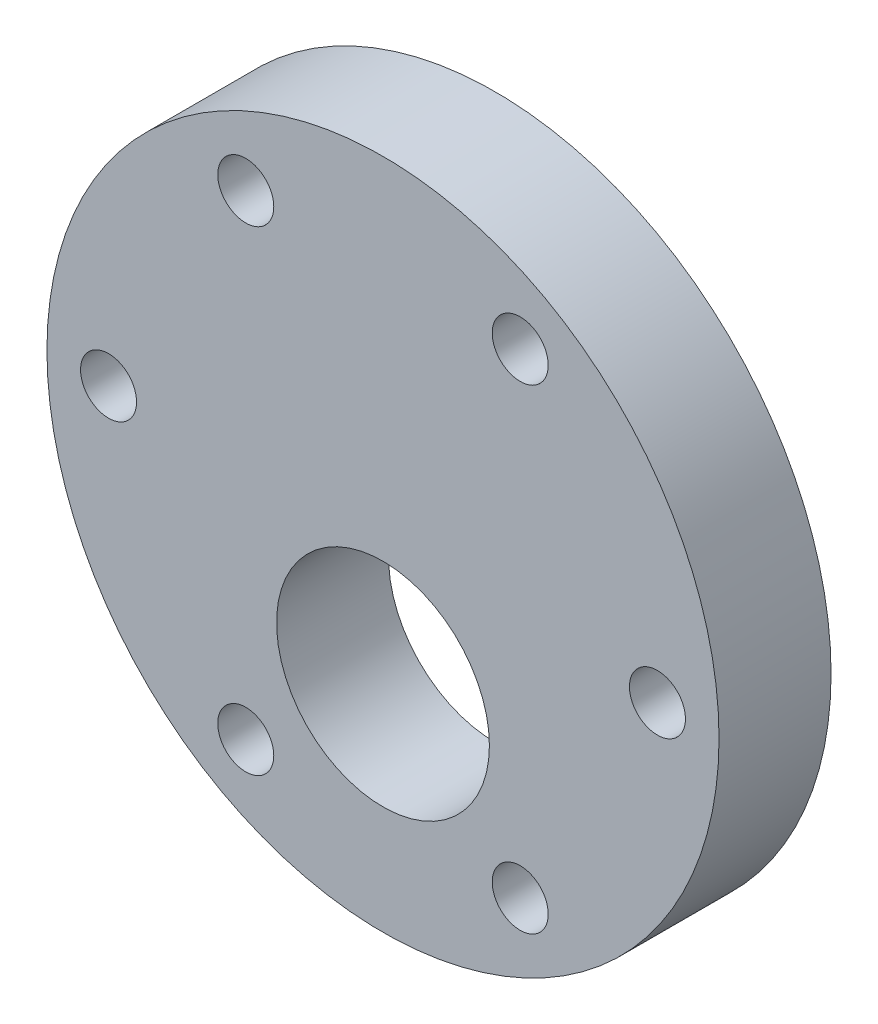
ISO-10303-21;
HEADER;
FILE_DESCRIPTION(('STEP AP214'),'2;1');
FILE_NAME('part.step','',(''),(''),'','','');
FILE_SCHEMA(('AUTOMOTIVE_DESIGN { 1 0 10303 214 1 1 1 1 }'));
ENDSEC;
DATA;
#1=APPLICATION_CONTEXT('core data for automotive mechanical design processes');
#2=APPLICATION_PROTOCOL_DEFINITION('international standard','automotive_design',2000,#1);
#3=PRODUCT_CONTEXT('',#1,'mechanical');
#4=PRODUCT('Part','Part','',(#3));
#5=PRODUCT_RELATED_PRODUCT_CATEGORY('part','',(#4));
#6=PRODUCT_DEFINITION_FORMATION('','',#4);
#7=PRODUCT_DEFINITION_CONTEXT('part definition',#1,'design');
#8=PRODUCT_DEFINITION('design','',#6,#7);
#9=PRODUCT_DEFINITION_SHAPE('','',#8);
#10=(LENGTH_UNIT() NAMED_UNIT(*) SI_UNIT(.MILLI.,.METRE.));
#11=(NAMED_UNIT(*) PLANE_ANGLE_UNIT() SI_UNIT($,.RADIAN.));
#12=(NAMED_UNIT(*) SI_UNIT($,.STERADIAN.) SOLID_ANGLE_UNIT());
#13=UNCERTAINTY_MEASURE_WITH_UNIT(LENGTH_MEASURE(1.E-05),#10,'distance_accuracy_value','');
#14=(GEOMETRIC_REPRESENTATION_CONTEXT(3) GLOBAL_UNCERTAINTY_ASSIGNED_CONTEXT((#13)) GLOBAL_UNIT_ASSIGNED_CONTEXT((#10,
#11,#12)) REPRESENTATION_CONTEXT('',''));
#15=CARTESIAN_POINT('',(0.,0.,0.));
#16=DIRECTION('',(0.,0.,1.));
#17=DIRECTION('',(1.,0.,0.));
#18=AXIS2_PLACEMENT_3D('',#15,#16,#17);
#19=CARTESIAN_POINT('',(0.,0.,6.35));
#20=DIRECTION('',(0.,0.,1.));
#21=DIRECTION('',(1.,0.,0.));
#22=AXIS2_PLACEMENT_3D('',#19,#20,#21);
#23=PLANE('',#22);
#24=CARTESIAN_POINT('',(-7.77874999999988,-13.473190219376,6.35));
#25=DIRECTION('',(0.,0.,1.));
#26=DIRECTION('',(1.,0.,0.));
#27=AXIS2_PLACEMENT_3D('',#24,#25,#26);
#28=CIRCLE('',#27,1.5875);
#29=CARTESIAN_POINT('',(-6.19124999999988,-13.473190219376,6.35));
#30=VERTEX_POINT('',#29);
#31=EDGE_CURVE('E94',#30,#30,#28,.T.);
#32=ORIENTED_EDGE('',*,*,#31,.F.);
#33=EDGE_LOOP('',(#32));
#34=FACE_BOUND('',#33,.T.);
#35=CARTESIAN_POINT('',(15.5574999999998,2.39275584412789E-13,6.35));
#36=DIRECTION('',(0.,0.,1.));
#37=DIRECTION('',(1.,0.,0.));
#38=AXIS2_PLACEMENT_3D('',#35,#36,#37);
#39=CIRCLE('',#38,1.5875);
#40=CARTESIAN_POINT('',(17.1449999999998,2.39275584412789E-13,6.35));
#41=VERTEX_POINT('',#40);
#42=EDGE_CURVE('E78',#41,#41,#39,.T.);
#43=ORIENTED_EDGE('',*,*,#42,.F.);
#44=EDGE_LOOP('',(#43));
#45=FACE_BOUND('',#44,.T.);
#46=CARTESIAN_POINT('',(-7.77874999999992,13.4731902193764,6.35));
#47=DIRECTION('',(0.,0.,1.));
#48=DIRECTION('',(1.,0.,0.));
#49=AXIS2_PLACEMENT_3D('',#46,#47,#48);
#50=CIRCLE('',#49,1.5875);
#51=CARTESIAN_POINT('',(-6.19124999999992,13.4731902193764,6.35));
#52=VERTEX_POINT('',#51);
#53=EDGE_CURVE('E62',#52,#52,#50,.T.);
#54=ORIENTED_EDGE('',*,*,#53,.F.);
#55=EDGE_LOOP('',(#54));
#56=FACE_BOUND('',#55,.T.);
#57=CARTESIAN_POINT('',(0.,0.,6.35));
#58=DIRECTION('',(0.,0.,1.));
#59=DIRECTION('',(1.,0.,0.));
#60=AXIS2_PLACEMENT_3D('',#57,#58,#59);
#61=CIRCLE('',#60,19.05);
#62=CARTESIAN_POINT('',(19.05,0.,6.35));
#63=VERTEX_POINT('',#62);
#64=EDGE_CURVE('E10',#63,#63,#61,.T.);
#65=ORIENTED_EDGE('',*,*,#64,.T.);
#66=EDGE_LOOP('',(#65));
#67=FACE_BOUND('',#66,.T.);
#68=CARTESIAN_POINT('',(0.,-6.858,6.35));
#69=DIRECTION('',(0.,0.,1.));
#70=DIRECTION('',(1.,0.,0.));
#71=AXIS2_PLACEMENT_3D('',#68,#69,#70);
#72=CIRCLE('',#71,6.0325);
#73=CARTESIAN_POINT('',(6.0325,-6.858,6.35));
#74=VERTEX_POINT('',#73);
#75=EDGE_CURVE('E56',#74,#74,#72,.T.);
#76=ORIENTED_EDGE('',*,*,#75,.F.);
#77=EDGE_LOOP('',(#76));
#78=FACE_BOUND('',#77,.T.);
#79=CARTESIAN_POINT('',(7.77874999999989,13.4731902193765,6.35));
#80=DIRECTION('',(0.,0.,1.));
#81=DIRECTION('',(1.,0.,0.));
#82=AXIS2_PLACEMENT_3D('',#79,#80,#81);
#83=CIRCLE('',#82,1.5875);
#84=CARTESIAN_POINT('',(9.36624999999989,13.4731902193765,6.35));
#85=VERTEX_POINT('',#84);
#86=EDGE_CURVE('E70',#85,#85,#83,.T.);
#87=ORIENTED_EDGE('',*,*,#86,.F.);
#88=EDGE_LOOP('',(#87));
#89=FACE_BOUND('',#88,.T.);
#90=CARTESIAN_POINT('',(7.77874999999993,-13.473190219376,6.35));
#91=DIRECTION('',(0.,0.,1.));
#92=DIRECTION('',(1.,0.,0.));
#93=AXIS2_PLACEMENT_3D('',#90,#91,#92);
#94=CIRCLE('',#93,1.5875);
#95=CARTESIAN_POINT('',(9.36624999999993,-13.473190219376,6.35));
#96=VERTEX_POINT('',#95);
#97=EDGE_CURVE('E86',#96,#96,#94,.T.);
#98=ORIENTED_EDGE('',*,*,#97,.F.);
#99=EDGE_LOOP('',(#98));
#100=FACE_BOUND('',#99,.T.);
#101=CARTESIAN_POINT('',(-15.5574999999998,1.95245329506852E-13,6.35));
#102=DIRECTION('',(0.,0.,1.));
#103=DIRECTION('',(1.,0.,0.));
#104=AXIS2_PLACEMENT_3D('',#101,#102,#103);
#105=CIRCLE('',#104,1.5875);
#106=CARTESIAN_POINT('',(-13.9699999999998,1.95245329506852E-13,6.35));
#107=VERTEX_POINT('',#106);
#108=EDGE_CURVE('E102',#107,#107,#105,.T.);
#109=ORIENTED_EDGE('',*,*,#108,.F.);
#110=EDGE_LOOP('',(#109));
#111=FACE_BOUND('',#110,.T.);
#112=ADVANCED_FACE('F43',(#34,#45,#56,#67,#78,#89,#100,#111),#23,.T.);
#113=CARTESIAN_POINT('',(0.,0.,0.));
#114=DIRECTION('',(0.,0.,1.));
#115=DIRECTION('',(1.,0.,0.));
#116=AXIS2_PLACEMENT_3D('',#113,#114,#115);
#117=PLANE('',#116);
#118=CARTESIAN_POINT('',(0.,0.,0.));
#119=DIRECTION('',(0.,0.,1.));
#120=DIRECTION('',(1.,0.,0.));
#121=AXIS2_PLACEMENT_3D('',#118,#119,#120);
#122=CIRCLE('',#121,19.05);
#123=CARTESIAN_POINT('',(19.05,0.,0.));
#124=VERTEX_POINT('',#123);
#125=EDGE_CURVE('E47',#124,#124,#122,.T.);
#126=ORIENTED_EDGE('',*,*,#125,.F.);
#127=EDGE_LOOP('',(#126));
#128=FACE_BOUND('',#127,.T.);
#129=CARTESIAN_POINT('',(0.,-6.858,0.));
#130=DIRECTION('',(0.,0.,1.));
#131=DIRECTION('',(1.,0.,0.));
#132=AXIS2_PLACEMENT_3D('',#129,#130,#131);
#133=CIRCLE('',#132,6.0325);
#134=CARTESIAN_POINT('',(6.0325,-6.858,0.));
#135=VERTEX_POINT('',#134);
#136=EDGE_CURVE('E58',#135,#135,#133,.T.);
#137=ORIENTED_EDGE('',*,*,#136,.T.);
#138=EDGE_LOOP('',(#137));
#139=FACE_BOUND('',#138,.T.);
#140=CARTESIAN_POINT('',(-7.77874999999992,13.4731902193764,0.));
#141=DIRECTION('',(0.,0.,1.));
#142=DIRECTION('',(1.,0.,0.));
#143=AXIS2_PLACEMENT_3D('',#140,#141,#142);
#144=CIRCLE('',#143,1.5875);
#145=CARTESIAN_POINT('',(-6.19124999999992,13.4731902193764,0.));
#146=VERTEX_POINT('',#145);
#147=EDGE_CURVE('E66',#146,#146,#144,.T.);
#148=ORIENTED_EDGE('',*,*,#147,.T.);
#149=EDGE_LOOP('',(#148));
#150=FACE_BOUND('',#149,.T.);
#151=CARTESIAN_POINT('',(7.77874999999989,13.4731902193765,0.));
#152=DIRECTION('',(0.,0.,1.));
#153=DIRECTION('',(1.,0.,0.));
#154=AXIS2_PLACEMENT_3D('',#151,#152,#153);
#155=CIRCLE('',#154,1.5875);
#156=CARTESIAN_POINT('',(9.36624999999989,13.4731902193765,0.));
#157=VERTEX_POINT('',#156);
#158=EDGE_CURVE('E74',#157,#157,#155,.T.);
#159=ORIENTED_EDGE('',*,*,#158,.T.);
#160=EDGE_LOOP('',(#159));
#161=FACE_BOUND('',#160,.T.);
#162=CARTESIAN_POINT('',(15.5574999999998,2.39275584412789E-13,0.));
#163=DIRECTION('',(0.,0.,1.));
#164=DIRECTION('',(1.,0.,0.));
#165=AXIS2_PLACEMENT_3D('',#162,#163,#164);
#166=CIRCLE('',#165,1.5875);
#167=CARTESIAN_POINT('',(17.1449999999998,2.39275584412789E-13,0.));
#168=VERTEX_POINT('',#167);
#169=EDGE_CURVE('E82',#168,#168,#166,.T.);
#170=ORIENTED_EDGE('',*,*,#169,.T.);
#171=EDGE_LOOP('',(#170));
#172=FACE_BOUND('',#171,.T.);
#173=CARTESIAN_POINT('',(7.77874999999993,-13.473190219376,0.));
#174=DIRECTION('',(0.,0.,1.));
#175=DIRECTION('',(1.,0.,0.));
#176=AXIS2_PLACEMENT_3D('',#173,#174,#175);
#177=CIRCLE('',#176,1.5875);
#178=CARTESIAN_POINT('',(9.36624999999993,-13.473190219376,0.));
#179=VERTEX_POINT('',#178);
#180=EDGE_CURVE('E90',#179,#179,#177,.T.);
#181=ORIENTED_EDGE('',*,*,#180,.T.);
#182=EDGE_LOOP('',(#181));
#183=FACE_BOUND('',#182,.T.);
#184=CARTESIAN_POINT('',(-7.77874999999988,-13.473190219376,0.));
#185=DIRECTION('',(0.,0.,1.));
#186=DIRECTION('',(1.,0.,0.));
#187=AXIS2_PLACEMENT_3D('',#184,#185,#186);
#188=CIRCLE('',#187,1.5875);
#189=CARTESIAN_POINT('',(-6.19124999999988,-13.473190219376,0.));
#190=VERTEX_POINT('',#189);
#191=EDGE_CURVE('E98',#190,#190,#188,.T.);
#192=ORIENTED_EDGE('',*,*,#191,.T.);
#193=EDGE_LOOP('',(#192));
#194=FACE_BOUND('',#193,.T.);
#195=CARTESIAN_POINT('',(-15.5574999999998,1.95245329506852E-13,0.));
#196=DIRECTION('',(0.,0.,1.));
#197=DIRECTION('',(1.,0.,0.));
#198=AXIS2_PLACEMENT_3D('',#195,#196,#197);
#199=CIRCLE('',#198,1.5875);
#200=CARTESIAN_POINT('',(-13.9699999999998,1.95245329506852E-13,0.));
#201=VERTEX_POINT('',#200);
#202=EDGE_CURVE('E106',#201,#201,#199,.T.);
#203=ORIENTED_EDGE('',*,*,#202,.T.);
#204=EDGE_LOOP('',(#203));
#205=FACE_BOUND('',#204,.T.);
#206=ADVANCED_FACE('F118',(#128,#139,#150,#161,#172,#183,#194,#205),#117,.F.);
#207=CARTESIAN_POINT('',(0.,0.,6.35));
#208=DIRECTION('',(0.,0.,-1.));
#209=DIRECTION('',(-1.,0.,0.));
#210=AXIS2_PLACEMENT_3D('',#207,#208,#209);
#211=CYLINDRICAL_SURFACE('',#210,19.05);
#212=ORIENTED_EDGE('',*,*,#64,.F.);
#213=EDGE_LOOP('',(#212));
#214=FACE_BOUND('',#213,.T.);
#215=ORIENTED_EDGE('',*,*,#125,.T.);
#216=EDGE_LOOP('',(#215));
#217=FACE_BOUND('',#216,.T.);
#218=ADVANCED_FACE('F45',(#214,#217),#211,.T.);
#219=CARTESIAN_POINT('',(0.,-6.858,6.35));
#220=DIRECTION('',(0.,0.,-1.));
#221=DIRECTION('',(-1.,0.,0.));
#222=AXIS2_PLACEMENT_3D('',#219,#220,#221);
#223=CYLINDRICAL_SURFACE('',#222,6.0325);
#224=ORIENTED_EDGE('',*,*,#75,.T.);
#225=EDGE_LOOP('',(#224));
#226=FACE_BOUND('',#225,.T.);
#227=ORIENTED_EDGE('',*,*,#136,.F.);
#228=EDGE_LOOP('',(#227));
#229=FACE_BOUND('',#228,.T.);
#230=ADVANCED_FACE('F128',(#226,#229),#223,.F.);
#231=CARTESIAN_POINT('',(-7.77874999999992,13.4731902193764,6.35));
#232=DIRECTION('',(0.,0.,-1.));
#233=DIRECTION('',(-1.,0.,0.));
#234=AXIS2_PLACEMENT_3D('',#231,#232,#233);
#235=CYLINDRICAL_SURFACE('',#234,1.5875);
#236=ORIENTED_EDGE('',*,*,#53,.T.);
#237=EDGE_LOOP('',(#236));
#238=FACE_BOUND('',#237,.T.);
#239=ORIENTED_EDGE('',*,*,#147,.F.);
#240=EDGE_LOOP('',(#239));
#241=FACE_BOUND('',#240,.T.);
#242=ADVANCED_FACE('F131',(#238,#241),#235,.F.);
#243=CARTESIAN_POINT('',(7.77874999999989,13.4731902193765,6.35));
#244=DIRECTION('',(0.,0.,-1.));
#245=DIRECTION('',(-1.,0.,0.));
#246=AXIS2_PLACEMENT_3D('',#243,#244,#245);
#247=CYLINDRICAL_SURFACE('',#246,1.5875);
#248=ORIENTED_EDGE('',*,*,#86,.T.);
#249=EDGE_LOOP('',(#248));
#250=FACE_BOUND('',#249,.T.);
#251=ORIENTED_EDGE('',*,*,#158,.F.);
#252=EDGE_LOOP('',(#251));
#253=FACE_BOUND('',#252,.T.);
#254=ADVANCED_FACE('F135',(#250,#253),#247,.F.);
#255=CARTESIAN_POINT('',(15.5574999999998,2.39275584412789E-13,6.35));
#256=DIRECTION('',(0.,0.,-1.));
#257=DIRECTION('',(-1.,0.,0.));
#258=AXIS2_PLACEMENT_3D('',#255,#256,#257);
#259=CYLINDRICAL_SURFACE('',#258,1.5875);
#260=ORIENTED_EDGE('',*,*,#42,.T.);
#261=EDGE_LOOP('',(#260));
#262=FACE_BOUND('',#261,.T.);
#263=ORIENTED_EDGE('',*,*,#169,.F.);
#264=EDGE_LOOP('',(#263));
#265=FACE_BOUND('',#264,.T.);
#266=ADVANCED_FACE('F139',(#262,#265),#259,.F.);
#267=CARTESIAN_POINT('',(7.77874999999993,-13.473190219376,6.35));
#268=DIRECTION('',(0.,0.,-1.));
#269=DIRECTION('',(-1.,0.,0.));
#270=AXIS2_PLACEMENT_3D('',#267,#268,#269);
#271=CYLINDRICAL_SURFACE('',#270,1.5875);
#272=ORIENTED_EDGE('',*,*,#97,.T.);
#273=EDGE_LOOP('',(#272));
#274=FACE_BOUND('',#273,.T.);
#275=ORIENTED_EDGE('',*,*,#180,.F.);
#276=EDGE_LOOP('',(#275));
#277=FACE_BOUND('',#276,.T.);
#278=ADVANCED_FACE('F143',(#274,#277),#271,.F.);
#279=CARTESIAN_POINT('',(-7.77874999999988,-13.473190219376,6.35));
#280=DIRECTION('',(0.,0.,-1.));
#281=DIRECTION('',(-1.,0.,0.));
#282=AXIS2_PLACEMENT_3D('',#279,#280,#281);
#283=CYLINDRICAL_SURFACE('',#282,1.5875);
#284=ORIENTED_EDGE('',*,*,#31,.T.);
#285=EDGE_LOOP('',(#284));
#286=FACE_BOUND('',#285,.T.);
#287=ORIENTED_EDGE('',*,*,#191,.F.);
#288=EDGE_LOOP('',(#287));
#289=FACE_BOUND('',#288,.T.);
#290=ADVANCED_FACE('F147',(#286,#289),#283,.F.);
#291=CARTESIAN_POINT('',(-15.5574999999998,1.95245329506852E-13,6.35));
#292=DIRECTION('',(0.,0.,-1.));
#293=DIRECTION('',(-1.,0.,0.));
#294=AXIS2_PLACEMENT_3D('',#291,#292,#293);
#295=CYLINDRICAL_SURFACE('',#294,1.5875);
#296=ORIENTED_EDGE('',*,*,#108,.T.);
#297=EDGE_LOOP('',(#296));
#298=FACE_BOUND('',#297,.T.);
#299=ORIENTED_EDGE('',*,*,#202,.F.);
#300=EDGE_LOOP('',(#299));
#301=FACE_BOUND('',#300,.T.);
#302=ADVANCED_FACE('F114',(#298,#301),#295,.F.);
#303=CLOSED_SHELL('',(#112,#206,#218,#230,#242,#254,#266,#278,#290,#302));
#304=MANIFOLD_SOLID_BREP('B2',#303);
#305=ADVANCED_BREP_SHAPE_REPRESENTATION('',(#18,#304),#14);
#306=SHAPE_DEFINITION_REPRESENTATION(#9,#305);
ENDSEC;
END-ISO-10303-21;
